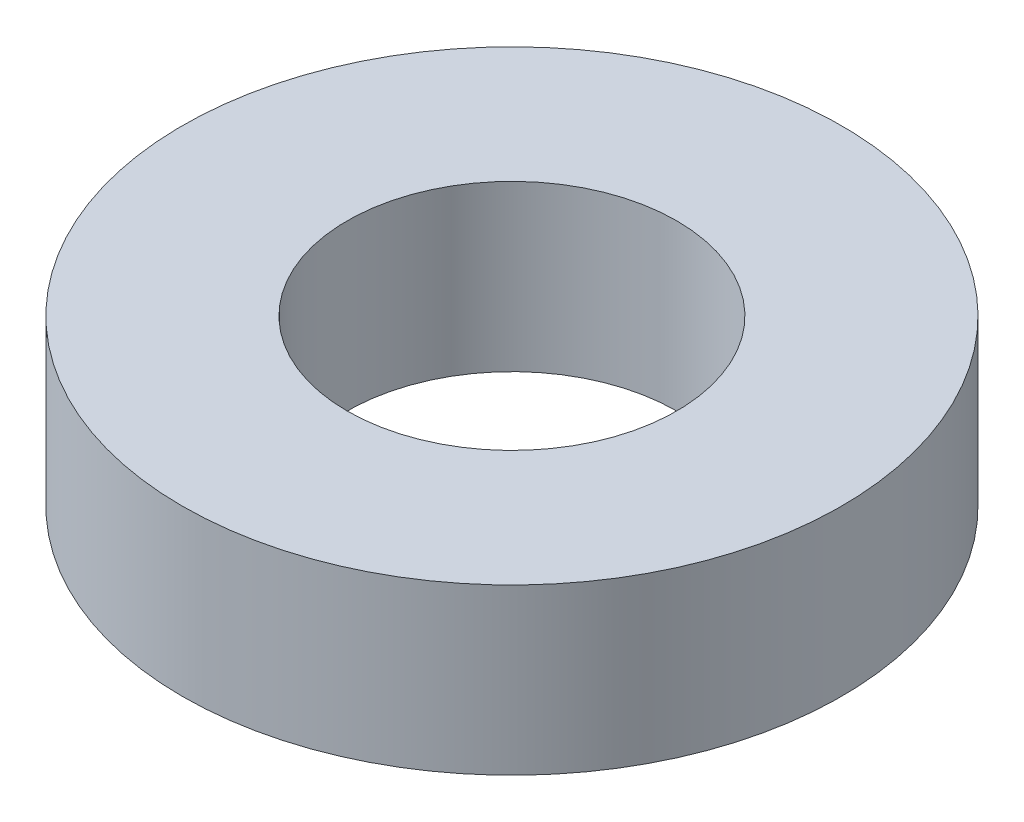
ISO-10303-21;
HEADER;
FILE_DESCRIPTION(('STEP AP214'),'2;1');
FILE_NAME('part.step','',(''),(''),'','','');
FILE_SCHEMA(('AUTOMOTIVE_DESIGN { 1 0 10303 214 1 1 1 1 }'));
ENDSEC;
DATA;
#1=APPLICATION_CONTEXT('core data for automotive mechanical design processes');
#2=APPLICATION_PROTOCOL_DEFINITION('international standard','automotive_design',2000,#1);
#3=PRODUCT_CONTEXT('',#1,'mechanical');
#4=PRODUCT('Part','Part','',(#3));
#5=PRODUCT_RELATED_PRODUCT_CATEGORY('part','',(#4));
#6=PRODUCT_DEFINITION_FORMATION('','',#4);
#7=PRODUCT_DEFINITION_CONTEXT('part definition',#1,'design');
#8=PRODUCT_DEFINITION('design','',#6,#7);
#9=PRODUCT_DEFINITION_SHAPE('','',#8);
#10=(LENGTH_UNIT() NAMED_UNIT(*) SI_UNIT(.MILLI.,.METRE.));
#11=(NAMED_UNIT(*) PLANE_ANGLE_UNIT() SI_UNIT($,.RADIAN.));
#12=(NAMED_UNIT(*) SI_UNIT($,.STERADIAN.) SOLID_ANGLE_UNIT());
#13=UNCERTAINTY_MEASURE_WITH_UNIT(LENGTH_MEASURE(1.E-05),#10,'distance_accuracy_value','');
#14=(GEOMETRIC_REPRESENTATION_CONTEXT(3) GLOBAL_UNCERTAINTY_ASSIGNED_CONTEXT((#13)) GLOBAL_UNIT_ASSIGNED_CONTEXT((#10,
#11,#12)) REPRESENTATION_CONTEXT('',''));
#15=CARTESIAN_POINT('',(0.,0.,0.));
#16=DIRECTION('',(0.,0.,1.));
#17=DIRECTION('',(1.,0.,0.));
#18=AXIS2_PLACEMENT_3D('',#15,#16,#17);
#19=CARTESIAN_POINT('',(0.,20.,0.));
#20=DIRECTION('',(0.,1.,0.));
#21=DIRECTION('',(0.,0.,1.));
#22=AXIS2_PLACEMENT_3D('',#19,#20,#21);
#23=PLANE('',#22);
#24=CARTESIAN_POINT('',(0.,20.,0.));
#25=DIRECTION('',(0.,1.,0.));
#26=DIRECTION('',(0.,0.,1.));
#27=AXIS2_PLACEMENT_3D('',#24,#25,#26);
#28=CIRCLE('',#27,40.);
#29=CARTESIAN_POINT('',(0.,20.,40.));
#30=VERTEX_POINT('',#29);
#31=EDGE_CURVE('E10',#30,#30,#28,.T.);
#32=ORIENTED_EDGE('',*,*,#31,.T.);
#33=EDGE_LOOP('',(#32));
#34=FACE_BOUND('',#33,.T.);
#35=CARTESIAN_POINT('',(0.,20.,0.));
#36=DIRECTION('',(0.,1.,0.));
#37=DIRECTION('',(0.,0.,1.));
#38=AXIS2_PLACEMENT_3D('',#35,#36,#37);
#39=CIRCLE('',#38,20.);
#40=CARTESIAN_POINT('',(0.,20.,20.));
#41=VERTEX_POINT('',#40);
#42=EDGE_CURVE('E44',#41,#41,#39,.T.);
#43=ORIENTED_EDGE('',*,*,#42,.F.);
#44=EDGE_LOOP('',(#43));
#45=FACE_BOUND('',#44,.T.);
#46=ADVANCED_FACE('F33',(#34,#45),#23,.T.);
#47=CARTESIAN_POINT('',(0.,0.,0.));
#48=DIRECTION('',(0.,1.,0.));
#49=DIRECTION('',(0.,0.,1.));
#50=AXIS2_PLACEMENT_3D('',#47,#48,#49);
#51=PLANE('',#50);
#52=CARTESIAN_POINT('',(0.,0.,0.));
#53=DIRECTION('',(0.,1.,0.));
#54=DIRECTION('',(0.,0.,1.));
#55=AXIS2_PLACEMENT_3D('',#52,#53,#54);
#56=CIRCLE('',#55,40.);
#57=CARTESIAN_POINT('',(0.,0.,40.));
#58=VERTEX_POINT('',#57);
#59=EDGE_CURVE('E37',#58,#58,#56,.T.);
#60=ORIENTED_EDGE('',*,*,#59,.F.);
#61=EDGE_LOOP('',(#60));
#62=FACE_BOUND('',#61,.T.);
#63=CARTESIAN_POINT('',(0.,0.,0.));
#64=DIRECTION('',(0.,1.,0.));
#65=DIRECTION('',(0.,0.,1.));
#66=AXIS2_PLACEMENT_3D('',#63,#64,#65);
#67=CIRCLE('',#66,20.);
#68=CARTESIAN_POINT('',(0.,0.,20.));
#69=VERTEX_POINT('',#68);
#70=EDGE_CURVE('E46',#69,#69,#67,.T.);
#71=ORIENTED_EDGE('',*,*,#70,.T.);
#72=EDGE_LOOP('',(#71));
#73=FACE_BOUND('',#72,.T.);
#74=ADVANCED_FACE('F56',(#62,#73),#51,.F.);
#75=CARTESIAN_POINT('',(0.,20.,0.));
#76=DIRECTION('',(0.,-1.,0.));
#77=DIRECTION('',(0.,0.,-1.));
#78=AXIS2_PLACEMENT_3D('',#75,#76,#77);
#79=CYLINDRICAL_SURFACE('',#78,40.);
#80=ORIENTED_EDGE('',*,*,#31,.F.);
#81=EDGE_LOOP('',(#80));
#82=FACE_BOUND('',#81,.T.);
#83=ORIENTED_EDGE('',*,*,#59,.T.);
#84=EDGE_LOOP('',(#83));
#85=FACE_BOUND('',#84,.T.);
#86=ADVANCED_FACE('F35',(#82,#85),#79,.T.);
#87=CARTESIAN_POINT('',(0.,20.,0.));
#88=DIRECTION('',(0.,-1.,0.));
#89=DIRECTION('',(0.,0.,-1.));
#90=AXIS2_PLACEMENT_3D('',#87,#88,#89);
#91=CYLINDRICAL_SURFACE('',#90,20.);
#92=ORIENTED_EDGE('',*,*,#42,.T.);
#93=EDGE_LOOP('',(#92));
#94=FACE_BOUND('',#93,.T.);
#95=ORIENTED_EDGE('',*,*,#70,.F.);
#96=EDGE_LOOP('',(#95));
#97=FACE_BOUND('',#96,.T.);
#98=ADVANCED_FACE('F52',(#94,#97),#91,.F.);
#99=CLOSED_SHELL('',(#46,#74,#86,#98));
#100=MANIFOLD_SOLID_BREP('B2',#99);
#101=ADVANCED_BREP_SHAPE_REPRESENTATION('',(#18,#100),#14);
#102=SHAPE_DEFINITION_REPRESENTATION(#9,#101);
ENDSEC;
END-ISO-10303-21;
